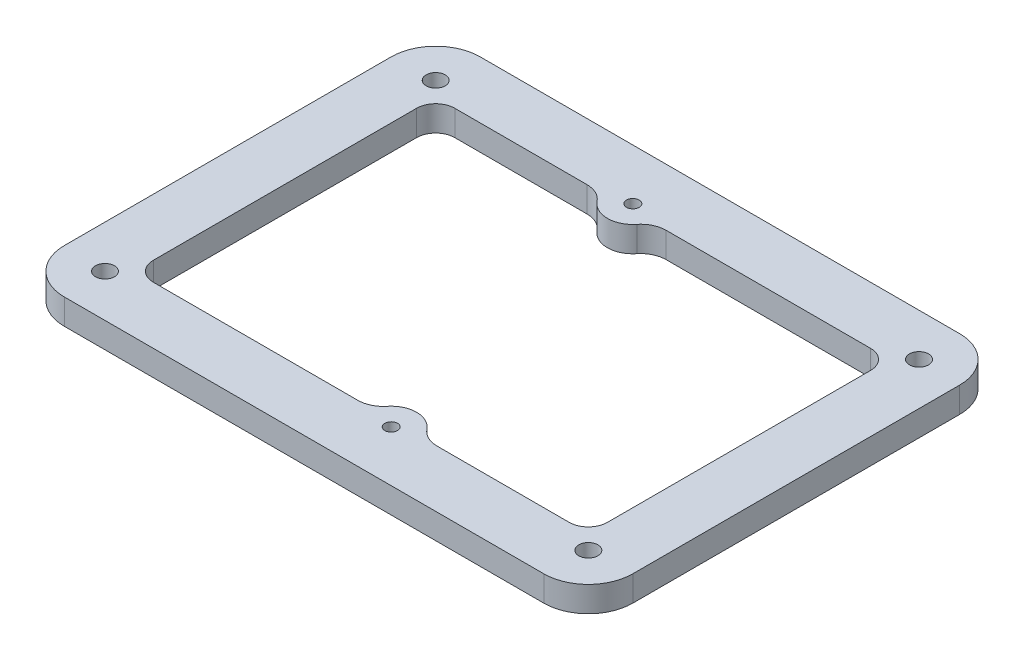
ISO-10303-21;
HEADER;
FILE_DESCRIPTION(('STEP AP214'),'2;1');
FILE_NAME('part.step','',(''),(''),'','','');
FILE_SCHEMA(('AUTOMOTIVE_DESIGN { 1 0 10303 214 1 1 1 1 }'));
ENDSEC;
DATA;
#1=APPLICATION_CONTEXT('core data for automotive mechanical design processes');
#2=APPLICATION_PROTOCOL_DEFINITION('international standard','automotive_design',2000,#1);
#3=PRODUCT_CONTEXT('',#1,'mechanical');
#4=PRODUCT('Part','Part','',(#3));
#5=PRODUCT_RELATED_PRODUCT_CATEGORY('part','',(#4));
#6=PRODUCT_DEFINITION_FORMATION('','',#4);
#7=PRODUCT_DEFINITION_CONTEXT('part definition',#1,'design');
#8=PRODUCT_DEFINITION('design','',#6,#7);
#9=PRODUCT_DEFINITION_SHAPE('','',#8);
#10=(LENGTH_UNIT() NAMED_UNIT(*) SI_UNIT(.MILLI.,.METRE.));
#11=(NAMED_UNIT(*) PLANE_ANGLE_UNIT() SI_UNIT($,.RADIAN.));
#12=(NAMED_UNIT(*) SI_UNIT($,.STERADIAN.) SOLID_ANGLE_UNIT());
#13=UNCERTAINTY_MEASURE_WITH_UNIT(LENGTH_MEASURE(1.E-05),#10,'distance_accuracy_value','');
#14=(GEOMETRIC_REPRESENTATION_CONTEXT(3) GLOBAL_UNCERTAINTY_ASSIGNED_CONTEXT((#13)) GLOBAL_UNIT_ASSIGNED_CONTEXT((#10,
#11,#12)) REPRESENTATION_CONTEXT('',''));
#15=CARTESIAN_POINT('',(0.,0.,0.));
#16=DIRECTION('',(0.,0.,1.));
#17=DIRECTION('',(1.,0.,0.));
#18=AXIS2_PLACEMENT_3D('',#15,#16,#17);
#19=CARTESIAN_POINT('',(0.,4.,0.));
#20=DIRECTION('',(0.,-1.,0.));
#21=DIRECTION('',(0.,0.,-1.));
#22=AXIS2_PLACEMENT_3D('',#19,#20,#21);
#23=PLANE('',#22);
#24=DIRECTION('',(0.,0.,-1.));
#25=VECTOR('',#24,1.);
#26=CARTESIAN_POINT('',(44.6966991411009,4.,20.6966991411009));
#27=LINE('',#26,#25);
#28=CARTESIAN_POINT('',(44.6966991411009,4.,25.6966991411009));
#29=VERTEX_POINT('',#28);
#30=CARTESIAN_POINT('',(44.6966991411009,4.,-25.6966991411009));
#31=VERTEX_POINT('',#30);
#32=EDGE_CURVE('E334',#29,#31,#27,.T.);
#33=ORIENTED_EDGE('',*,*,#32,.T.);
#34=CARTESIAN_POINT('',(37.6966991411009,4.,-25.6966991411009));
#35=DIRECTION('',(0.,-1.,0.));
#36=DIRECTION('',(0.,0.,-1.));
#37=AXIS2_PLACEMENT_3D('',#34,#35,#36);
#38=CIRCLE('',#37,7.00000000000001);
#39=CARTESIAN_POINT('',(37.6966991411009,4.,-32.6966991411009));
#40=VERTEX_POINT('',#39);
#41=EDGE_CURVE('E369',#31,#40,#38,.F.);
#42=ORIENTED_EDGE('',*,*,#41,.T.);
#43=DIRECTION('',(-1.,0.,0.));
#44=VECTOR('',#43,1.);
#45=CARTESIAN_POINT('',(-32.6966991411009,4.,-32.6966991411009));
#46=LINE('',#45,#44);
#47=CARTESIAN_POINT('',(-37.6966991411009,4.,-32.6966991411009));
#48=VERTEX_POINT('',#47);
#49=EDGE_CURVE('E326',#40,#48,#46,.T.);
#50=ORIENTED_EDGE('',*,*,#49,.T.);
#51=CARTESIAN_POINT('',(-37.6966991411009,4.,-25.6966991411009));
#52=DIRECTION('',(0.,-1.,0.));
#53=DIRECTION('',(0.,0.,-1.));
#54=AXIS2_PLACEMENT_3D('',#51,#52,#53);
#55=CIRCLE('',#54,7.00000000000001);
#56=CARTESIAN_POINT('',(-44.6966991411009,4.,-25.6966991411009));
#57=VERTEX_POINT('',#56);
#58=EDGE_CURVE('E367',#48,#57,#55,.F.);
#59=ORIENTED_EDGE('',*,*,#58,.T.);
#60=DIRECTION('',(0.,0.,1.));
#61=VECTOR('',#60,1.);
#62=CARTESIAN_POINT('',(-44.6966991411009,4.,-20.6966991411009));
#63=LINE('',#62,#61);
#64=CARTESIAN_POINT('',(-44.6966991411009,4.,25.6966991411009));
#65=VERTEX_POINT('',#64);
#66=EDGE_CURVE('E329',#57,#65,#63,.T.);
#67=ORIENTED_EDGE('',*,*,#66,.T.);
#68=CARTESIAN_POINT('',(-37.6966991411009,4.,25.6966991411009));
#69=DIRECTION('',(0.,-1.,0.));
#70=DIRECTION('',(0.,0.,-1.));
#71=AXIS2_PLACEMENT_3D('',#68,#69,#70);
#72=CIRCLE('',#71,7.00000000000001);
#73=CARTESIAN_POINT('',(-37.6966991411009,4.,32.6966991411009));
#74=VERTEX_POINT('',#73);
#75=EDGE_CURVE('E55',#65,#74,#72,.F.);
#76=ORIENTED_EDGE('',*,*,#75,.T.);
#77=DIRECTION('',(1.,0.,0.));
#78=VECTOR('',#77,1.);
#79=CARTESIAN_POINT('',(-32.6966991411009,4.,32.6966991411009));
#80=LINE('',#79,#78);
#81=CARTESIAN_POINT('',(37.6966991411009,4.,32.6966991411009));
#82=VERTEX_POINT('',#81);
#83=EDGE_CURVE('E332',#74,#82,#80,.T.);
#84=ORIENTED_EDGE('',*,*,#83,.T.);
#85=CARTESIAN_POINT('',(37.6966991411009,4.,25.6966991411009));
#86=DIRECTION('',(0.,-1.,0.));
#87=DIRECTION('',(0.,0.,-1.));
#88=AXIS2_PLACEMENT_3D('',#85,#86,#87);
#89=CIRCLE('',#88,7.00000000000001);
#90=EDGE_CURVE('E365',#82,#29,#89,.F.);
#91=ORIENTED_EDGE('',*,*,#90,.T.);
#92=EDGE_LOOP('',(#33,#42,#50,#59,#67,#76,#84,#91));
#93=FACE_BOUND('',#92,.T.);
#94=CARTESIAN_POINT('',(-11.9423546821787,4.,-19.6966991411009));
#95=DIRECTION('',(0.,1.,0.));
#96=DIRECTION('',(0.,0.,1.));
#97=AXIS2_PLACEMENT_3D('',#94,#95,#96);
#98=CIRCLE('',#97,4.);
#99=CARTESIAN_POINT('',(-8.82117772850447,4.,-22.198349481147));
#100=VERTEX_POINT('',#99);
#101=CARTESIAN_POINT('',(-11.9423546821787,4.,-23.6966991411009));
#102=VERTEX_POINT('',#101);
#103=EDGE_CURVE('E197',#100,#102,#98,.T.);
#104=ORIENTED_EDGE('',*,*,#103,.F.);
#105=CARTESIAN_POINT('',(-5.7000007748302,4.,-24.699999821193));
#106=DIRECTION('',(0.,-1.,0.));
#107=DIRECTION('',(0.,0.,1.));
#108=AXIS2_PLACEMENT_3D('',#105,#106,#107);
#109=CIRCLE('',#108,4.);
#110=CARTESIAN_POINT('',(-2.57882382115593,4.,-22.198349481147));
#111=VERTEX_POINT('',#110);
#112=EDGE_CURVE('E251',#111,#100,#109,.T.);
#113=ORIENTED_EDGE('',*,*,#112,.F.);
#114=CARTESIAN_POINT('',(0.542353132518346,4.,-19.6966991411009));
#115=DIRECTION('',(0.,1.,0.));
#116=DIRECTION('',(0.,0.,-1.));
#117=AXIS2_PLACEMENT_3D('',#114,#115,#116);
#118=CIRCLE('',#117,4.);
#119=CARTESIAN_POINT('',(0.542353132518346,4.,-23.6966991411009));
#120=VERTEX_POINT('',#119);
#121=EDGE_CURVE('E248',#120,#111,#118,.T.);
#122=ORIENTED_EDGE('',*,*,#121,.F.);
#123=DIRECTION('',(-1.,0.,0.));
#124=VECTOR('',#123,1.);
#125=CARTESIAN_POINT('',(0.542353132518344,4.,-23.6966991411009));
#126=LINE('',#125,#124);
#127=CARTESIAN_POINT('',(32.6966991411009,4.,-23.6966991411009));
#128=VERTEX_POINT('',#127);
#129=EDGE_CURVE('E246',#128,#120,#126,.T.);
#130=ORIENTED_EDGE('',*,*,#129,.F.);
#131=CARTESIAN_POINT('',(32.6966991411009,4.,-20.6966991411009));
#132=DIRECTION('',(0.,1.,0.));
#133=DIRECTION('',(0.,0.,1.));
#134=AXIS2_PLACEMENT_3D('',#131,#132,#133);
#135=CIRCLE('',#134,3.);
#136=CARTESIAN_POINT('',(35.6966991411009,4.,-20.6966991411009));
#137=VERTEX_POINT('',#136);
#138=EDGE_CURVE('E244',#137,#128,#135,.T.);
#139=ORIENTED_EDGE('',*,*,#138,.F.);
#140=DIRECTION('',(0.,0.,-1.));
#141=VECTOR('',#140,1.);
#142=CARTESIAN_POINT('',(35.6966991411009,4.,-20.6966991411009));
#143=LINE('',#142,#141);
#144=CARTESIAN_POINT('',(35.6966991411009,4.,20.6966991411009));
#145=VERTEX_POINT('',#144);
#146=EDGE_CURVE('E242',#145,#137,#143,.T.);
#147=ORIENTED_EDGE('',*,*,#146,.F.);
#148=CARTESIAN_POINT('',(32.6966991411009,4.,20.6966991411009));
#149=DIRECTION('',(0.,1.,0.));
#150=DIRECTION('',(0.,0.,1.));
#151=AXIS2_PLACEMENT_3D('',#148,#149,#150);
#152=CIRCLE('',#151,3.00000000000001);
#153=CARTESIAN_POINT('',(32.6966991411009,4.,23.6966991411009));
#154=VERTEX_POINT('',#153);
#155=EDGE_CURVE('E240',#154,#145,#152,.T.);
#156=ORIENTED_EDGE('',*,*,#155,.F.);
#157=DIRECTION('',(1.,0.,0.));
#158=VECTOR('',#157,1.);
#159=CARTESIAN_POINT('',(11.9423528458877,4.,23.6966991411009));
#160=LINE('',#159,#158);
#161=CARTESIAN_POINT('',(11.9423528458877,4.,23.6966991411009));
#162=VERTEX_POINT('',#161);
#163=EDGE_CURVE('E238',#162,#154,#160,.T.);
#164=ORIENTED_EDGE('',*,*,#163,.F.);
#165=CARTESIAN_POINT('',(11.9423528458877,4.,19.6966991411009));
#166=DIRECTION('',(0.,1.,0.));
#167=DIRECTION('',(0.,0.,1.));
#168=AXIS2_PLACEMENT_3D('',#165,#166,#167);
#169=CIRCLE('',#168,4.);
#170=CARTESIAN_POINT('',(8.82117603552874,4.,22.1983496599539));
#171=VERTEX_POINT('',#170);
#172=EDGE_CURVE('E236',#171,#162,#169,.T.);
#173=ORIENTED_EDGE('',*,*,#172,.F.);
#174=CARTESIAN_POINT('',(5.69999922516982,4.,24.700000178807));
#175=DIRECTION('',(0.,-1.,0.));
#176=DIRECTION('',(0.,0.,-1.));
#177=AXIS2_PLACEMENT_3D('',#174,#175,#176);
#178=CIRCLE('',#177,4.);
#179=CARTESIAN_POINT('',(2.57882241481089,4.,22.1983496599539));
#180=VERTEX_POINT('',#179);
#181=EDGE_CURVE('E234',#180,#171,#178,.T.);
#182=ORIENTED_EDGE('',*,*,#181,.F.);
#183=CARTESIAN_POINT('',(-0.542354395548028,4.,19.6966991411009));
#184=DIRECTION('',(0.,1.,0.));
#185=DIRECTION('',(0.,0.,-1.));
#186=AXIS2_PLACEMENT_3D('',#183,#184,#185);
#187=CIRCLE('',#186,4.);
#188=CARTESIAN_POINT('',(-0.542354395548027,4.,23.6966991411009));
#189=VERTEX_POINT('',#188);
#190=EDGE_CURVE('E232',#189,#180,#187,.T.);
#191=ORIENTED_EDGE('',*,*,#190,.F.);
#192=DIRECTION('',(1.,0.,0.));
#193=VECTOR('',#192,1.);
#194=CARTESIAN_POINT('',(-32.6966991411009,4.,23.6966991411009));
#195=LINE('',#194,#193);
#196=CARTESIAN_POINT('',(-32.6966991411009,4.,23.6966991411009));
#197=VERTEX_POINT('',#196);
#198=EDGE_CURVE('E230',#197,#189,#195,.T.);
#199=ORIENTED_EDGE('',*,*,#198,.F.);
#200=CARTESIAN_POINT('',(-32.6966991411009,4.,20.6966991411009));
#201=DIRECTION('',(0.,1.,0.));
#202=DIRECTION('',(0.,0.,1.));
#203=AXIS2_PLACEMENT_3D('',#200,#201,#202);
#204=CIRCLE('',#203,3.);
#205=CARTESIAN_POINT('',(-35.6966991411009,4.,20.6966991411009));
#206=VERTEX_POINT('',#205);
#207=EDGE_CURVE('E228',#206,#197,#204,.T.);
#208=ORIENTED_EDGE('',*,*,#207,.F.);
#209=DIRECTION('',(0.,0.,1.));
#210=VECTOR('',#209,1.);
#211=CARTESIAN_POINT('',(-35.6966991411009,4.,-20.6966991411009));
#212=LINE('',#211,#210);
#213=CARTESIAN_POINT('',(-35.6966991411009,4.,-20.6966991411009));
#214=VERTEX_POINT('',#213);
#215=EDGE_CURVE('E223',#214,#206,#212,.T.);
#216=ORIENTED_EDGE('',*,*,#215,.F.);
#217=CARTESIAN_POINT('',(-32.6966991411009,4.,-20.6966991411009));
#218=DIRECTION('',(0.,1.,0.));
#219=DIRECTION('',(0.,0.,1.));
#220=AXIS2_PLACEMENT_3D('',#217,#218,#219);
#221=CIRCLE('',#220,3.);
#222=CARTESIAN_POINT('',(-32.6966991411009,4.,-23.6966991411009));
#223=VERTEX_POINT('',#222);
#224=EDGE_CURVE('E221',#223,#214,#221,.T.);
#225=ORIENTED_EDGE('',*,*,#224,.F.);
#226=DIRECTION('',(-1.,0.,0.));
#227=VECTOR('',#226,1.);
#228=CARTESIAN_POINT('',(-32.6966991411009,4.,-23.6966991411009));
#229=LINE('',#228,#227);
#230=EDGE_CURVE('E207',#102,#223,#229,.T.);
#231=ORIENTED_EDGE('',*,*,#230,.F.);
#232=EDGE_LOOP('',(#104,#113,#122,#130,#139,#147,#156,#164,#173,#182,#191,#199,#208,#216,#225,#231));
#233=FACE_BOUND('',#232,.T.);
#234=CARTESIAN_POINT('',(-38.,4.,-26.));
#235=DIRECTION('',(0.,1.,0.));
#236=DIRECTION('',(0.,0.,-1.));
#237=AXIS2_PLACEMENT_3D('',#234,#235,#236);
#238=CIRCLE('',#237,1.5);
#239=CARTESIAN_POINT('',(-38.,4.,-27.5));
#240=VERTEX_POINT('',#239);
#241=EDGE_CURVE('E255',#240,#240,#238,.T.);
#242=ORIENTED_EDGE('',*,*,#241,.F.);
#243=EDGE_LOOP('',(#242));
#244=FACE_BOUND('',#243,.T.);
#245=CARTESIAN_POINT('',(38.,4.,26.));
#246=DIRECTION('',(0.,1.,0.));
#247=DIRECTION('',(0.,0.,-1.));
#248=AXIS2_PLACEMENT_3D('',#245,#246,#247);
#249=CIRCLE('',#248,1.5);
#250=CARTESIAN_POINT('',(38.,4.,24.5));
#251=VERTEX_POINT('',#250);
#252=EDGE_CURVE('E800',#251,#251,#249,.T.);
#253=ORIENTED_EDGE('',*,*,#252,.F.);
#254=EDGE_LOOP('',(#253));
#255=FACE_BOUND('',#254,.T.);
#256=CARTESIAN_POINT('',(38.,4.,-26.));
#257=DIRECTION('',(0.,1.,0.));
#258=DIRECTION('',(0.,0.,1.));
#259=AXIS2_PLACEMENT_3D('',#256,#257,#258);
#260=CIRCLE('',#259,1.5);
#261=CARTESIAN_POINT('',(38.,4.,-24.5));
#262=VERTEX_POINT('',#261);
#263=EDGE_CURVE('E795',#262,#262,#260,.T.);
#264=ORIENTED_EDGE('',*,*,#263,.F.);
#265=EDGE_LOOP('',(#264));
#266=FACE_BOUND('',#265,.T.);
#267=CARTESIAN_POINT('',(-38.,4.,26.));
#268=DIRECTION('',(0.,1.,0.));
#269=DIRECTION('',(0.,0.,1.));
#270=AXIS2_PLACEMENT_3D('',#267,#268,#269);
#271=CIRCLE('',#270,1.5);
#272=CARTESIAN_POINT('',(-38.,4.,27.5));
#273=VERTEX_POINT('',#272);
#274=EDGE_CURVE('E790',#273,#273,#271,.T.);
#275=ORIENTED_EDGE('',*,*,#274,.F.);
#276=EDGE_LOOP('',(#275));
#277=FACE_BOUND('',#276,.T.);
#278=CARTESIAN_POINT('',(-5.7000007748302,4.,-24.699999821193));
#279=DIRECTION('',(0.,1.,0.));
#280=DIRECTION('',(0.,0.,1.));
#281=AXIS2_PLACEMENT_3D('',#278,#279,#280);
#282=CIRCLE('',#281,1.00000000000001);
#283=CARTESIAN_POINT('',(-5.7000007748302,4.,-23.699999821193));
#284=VERTEX_POINT('',#283);
#285=EDGE_CURVE('E785',#284,#284,#282,.T.);
#286=ORIENTED_EDGE('',*,*,#285,.F.);
#287=EDGE_LOOP('',(#286));
#288=FACE_BOUND('',#287,.T.);
#289=CARTESIAN_POINT('',(5.69999922516982,4.,24.700000178807));
#290=DIRECTION('',(0.,1.,0.));
#291=DIRECTION('',(0.,0.,1.));
#292=AXIS2_PLACEMENT_3D('',#289,#290,#291);
#293=CIRCLE('',#292,1.00000000000001);
#294=CARTESIAN_POINT('',(5.69999922516982,4.,25.700000178807));
#295=VERTEX_POINT('',#294);
#296=EDGE_CURVE('E779',#295,#295,#293,.T.);
#297=ORIENTED_EDGE('',*,*,#296,.F.);
#298=EDGE_LOOP('',(#297));
#299=FACE_BOUND('',#298,.T.);
#300=ADVANCED_FACE('F35',(#93,#233,#244,#255,#266,#277,#288,#299),#23,.F.);
#301=CARTESIAN_POINT('',(0.,0.,0.));
#302=DIRECTION('',(0.,-1.,0.));
#303=DIRECTION('',(0.,0.,-1.));
#304=AXIS2_PLACEMENT_3D('',#301,#302,#303);
#305=PLANE('',#304);
#306=CARTESIAN_POINT('',(-5.7000007748302,0.,-24.699999821193));
#307=DIRECTION('',(0.,1.,0.));
#308=DIRECTION('',(0.,0.,1.));
#309=AXIS2_PLACEMENT_3D('',#306,#307,#308);
#310=CIRCLE('',#309,1.00000000000001);
#311=CARTESIAN_POINT('',(-5.7000007748302,0.,-23.699999821193));
#312=VERTEX_POINT('',#311);
#313=EDGE_CURVE('E782',#312,#312,#310,.T.);
#314=ORIENTED_EDGE('',*,*,#313,.T.);
#315=EDGE_LOOP('',(#314));
#316=FACE_BOUND('',#315,.T.);
#317=CARTESIAN_POINT('',(38.,0.,-26.));
#318=DIRECTION('',(0.,1.,0.));
#319=DIRECTION('',(0.,0.,1.));
#320=AXIS2_PLACEMENT_3D('',#317,#318,#319);
#321=CIRCLE('',#320,1.5);
#322=CARTESIAN_POINT('',(38.,0.,-24.5));
#323=VERTEX_POINT('',#322);
#324=EDGE_CURVE('E793',#323,#323,#321,.T.);
#325=ORIENTED_EDGE('',*,*,#324,.T.);
#326=EDGE_LOOP('',(#325));
#327=FACE_BOUND('',#326,.T.);
#328=CARTESIAN_POINT('',(-38.,0.,-26.));
#329=DIRECTION('',(0.,1.,0.));
#330=DIRECTION('',(0.,0.,-1.));
#331=AXIS2_PLACEMENT_3D('',#328,#329,#330);
#332=CIRCLE('',#331,1.5);
#333=CARTESIAN_POINT('',(-38.,0.,-27.5));
#334=VERTEX_POINT('',#333);
#335=EDGE_CURVE('E803',#334,#334,#332,.T.);
#336=ORIENTED_EDGE('',*,*,#335,.T.);
#337=EDGE_LOOP('',(#336));
#338=FACE_BOUND('',#337,.T.);
#339=DIRECTION('',(-1.,0.,0.));
#340=VECTOR('',#339,1.);
#341=CARTESIAN_POINT('',(-32.6966991411009,0.,-32.6966991411009));
#342=LINE('',#341,#340);
#343=CARTESIAN_POINT('',(37.6966991411009,0.,-32.6966991411009));
#344=VERTEX_POINT('',#343);
#345=CARTESIAN_POINT('',(-37.6966991411009,0.,-32.6966991411009));
#346=VERTEX_POINT('',#345);
#347=EDGE_CURVE('E330',#344,#346,#342,.T.);
#348=ORIENTED_EDGE('',*,*,#347,.F.);
#349=CARTESIAN_POINT('',(37.6966991411009,0.,-25.6966991411009));
#350=DIRECTION('',(0.,-1.,0.));
#351=DIRECTION('',(0.,0.,-1.));
#352=AXIS2_PLACEMENT_3D('',#349,#350,#351);
#353=CIRCLE('',#352,7.00000000000001);
#354=CARTESIAN_POINT('',(44.6966991411009,0.,-25.6966991411009));
#355=VERTEX_POINT('',#354);
#356=EDGE_CURVE('E357',#344,#355,#353,.T.);
#357=ORIENTED_EDGE('',*,*,#356,.T.);
#358=DIRECTION('',(0.,0.,-1.));
#359=VECTOR('',#358,1.);
#360=CARTESIAN_POINT('',(44.6966991411009,0.,-20.6966991411009));
#361=LINE('',#360,#359);
#362=CARTESIAN_POINT('',(44.6966991411009,0.,25.6966991411009));
#363=VERTEX_POINT('',#362);
#364=EDGE_CURVE('E342',#363,#355,#361,.T.);
#365=ORIENTED_EDGE('',*,*,#364,.F.);
#366=CARTESIAN_POINT('',(37.6966991411009,0.,25.6966991411009));
#367=DIRECTION('',(0.,-1.,0.));
#368=DIRECTION('',(0.,0.,-1.));
#369=AXIS2_PLACEMENT_3D('',#366,#367,#368);
#370=CIRCLE('',#369,7.00000000000001);
#371=CARTESIAN_POINT('',(37.6966991411009,0.,32.6966991411009));
#372=VERTEX_POINT('',#371);
#373=EDGE_CURVE('E353',#363,#372,#370,.T.);
#374=ORIENTED_EDGE('',*,*,#373,.T.);
#375=DIRECTION('',(1.,0.,0.));
#376=VECTOR('',#375,1.);
#377=CARTESIAN_POINT('',(32.6966991411008,0.,32.6966991411009));
#378=LINE('',#377,#376);
#379=CARTESIAN_POINT('',(-37.6966991411009,0.,32.6966991411009));
#380=VERTEX_POINT('',#379);
#381=EDGE_CURVE('E340',#380,#372,#378,.T.);
#382=ORIENTED_EDGE('',*,*,#381,.F.);
#383=CARTESIAN_POINT('',(-37.6966991411009,0.,25.6966991411009));
#384=DIRECTION('',(0.,-1.,0.));
#385=DIRECTION('',(0.,0.,-1.));
#386=AXIS2_PLACEMENT_3D('',#383,#384,#385);
#387=CIRCLE('',#386,7.00000000000001);
#388=CARTESIAN_POINT('',(-44.6966991411009,0.,25.6966991411009));
#389=VERTEX_POINT('',#388);
#390=EDGE_CURVE('E351',#380,#389,#387,.T.);
#391=ORIENTED_EDGE('',*,*,#390,.T.);
#392=DIRECTION('',(0.,0.,1.));
#393=VECTOR('',#392,1.);
#394=CARTESIAN_POINT('',(-44.6966991411009,0.,20.6966991411009));
#395=LINE('',#394,#393);
#396=CARTESIAN_POINT('',(-44.6966991411009,0.,-25.6966991411009));
#397=VERTEX_POINT('',#396);
#398=EDGE_CURVE('E215',#397,#389,#395,.T.);
#399=ORIENTED_EDGE('',*,*,#398,.F.);
#400=CARTESIAN_POINT('',(-37.6966991411009,0.,-25.6966991411009));
#401=DIRECTION('',(0.,-1.,0.));
#402=DIRECTION('',(0.,0.,-1.));
#403=AXIS2_PLACEMENT_3D('',#400,#401,#402);
#404=CIRCLE('',#403,7.00000000000001);
#405=EDGE_CURVE('E355',#397,#346,#404,.T.);
#406=ORIENTED_EDGE('',*,*,#405,.T.);
#407=EDGE_LOOP('',(#348,#357,#365,#374,#382,#391,#399,#406));
#408=FACE_BOUND('',#407,.T.);
#409=CARTESIAN_POINT('',(-5.7000007748302,0.,-24.699999821193));
#410=DIRECTION('',(0.,-1.,0.));
#411=DIRECTION('',(0.,0.,1.));
#412=AXIS2_PLACEMENT_3D('',#409,#410,#411);
#413=CIRCLE('',#412,4.);
#414=CARTESIAN_POINT('',(-2.57882382115593,0.,-22.198349481147));
#415=VERTEX_POINT('',#414);
#416=CARTESIAN_POINT('',(-8.82117772850447,0.,-22.198349481147));
#417=VERTEX_POINT('',#416);
#418=EDGE_CURVE('E208',#415,#417,#413,.T.);
#419=ORIENTED_EDGE('',*,*,#418,.T.);
#420=CARTESIAN_POINT('',(-11.9423546821787,0.,-19.6966991411009));
#421=DIRECTION('',(0.,1.,0.));
#422=DIRECTION('',(0.,0.,1.));
#423=AXIS2_PLACEMENT_3D('',#420,#421,#422);
#424=CIRCLE('',#423,4.);
#425=CARTESIAN_POINT('',(-11.9423546821787,0.,-23.6966991411009));
#426=VERTEX_POINT('',#425);
#427=EDGE_CURVE('E253',#417,#426,#424,.T.);
#428=ORIENTED_EDGE('',*,*,#427,.T.);
#429=DIRECTION('',(-1.,0.,0.));
#430=VECTOR('',#429,1.);
#431=CARTESIAN_POINT('',(-32.6966991411009,0.,-23.6966991411009));
#432=LINE('',#431,#430);
#433=CARTESIAN_POINT('',(-32.6966991411009,0.,-23.6966991411009));
#434=VERTEX_POINT('',#433);
#435=EDGE_CURVE('E214',#426,#434,#432,.T.);
#436=ORIENTED_EDGE('',*,*,#435,.T.);
#437=CARTESIAN_POINT('',(-32.6966991411009,0.,-20.6966991411009));
#438=DIRECTION('',(0.,1.,0.));
#439=DIRECTION('',(0.,0.,1.));
#440=AXIS2_PLACEMENT_3D('',#437,#438,#439);
#441=CIRCLE('',#440,3.);
#442=CARTESIAN_POINT('',(-35.6966991411009,0.,-20.6966991411009));
#443=VERTEX_POINT('',#442);
#444=EDGE_CURVE('E257',#434,#443,#441,.T.);
#445=ORIENTED_EDGE('',*,*,#444,.T.);
#446=DIRECTION('',(0.,0.,1.));
#447=VECTOR('',#446,1.);
#448=CARTESIAN_POINT('',(-35.6966991411009,0.,-20.6966991411009));
#449=LINE('',#448,#447);
#450=CARTESIAN_POINT('',(-35.6966991411009,0.,20.6966991411009));
#451=VERTEX_POINT('',#450);
#452=EDGE_CURVE('E260',#443,#451,#449,.T.);
#453=ORIENTED_EDGE('',*,*,#452,.T.);
#454=CARTESIAN_POINT('',(-32.6966991411009,0.,20.6966991411009));
#455=DIRECTION('',(0.,1.,0.));
#456=DIRECTION('',(0.,0.,1.));
#457=AXIS2_PLACEMENT_3D('',#454,#455,#456);
#458=CIRCLE('',#457,3.);
#459=CARTESIAN_POINT('',(-32.6966991411009,0.,23.6966991411009));
#460=VERTEX_POINT('',#459);
#461=EDGE_CURVE('E263',#451,#460,#458,.T.);
#462=ORIENTED_EDGE('',*,*,#461,.T.);
#463=DIRECTION('',(1.,0.,0.));
#464=VECTOR('',#463,1.);
#465=CARTESIAN_POINT('',(-32.6966991411009,0.,23.6966991411009));
#466=LINE('',#465,#464);
#467=CARTESIAN_POINT('',(-0.542354395548027,0.,23.6966991411009));
#468=VERTEX_POINT('',#467);
#469=EDGE_CURVE('E266',#460,#468,#466,.T.);
#470=ORIENTED_EDGE('',*,*,#469,.T.);
#471=CARTESIAN_POINT('',(-0.542354395548028,0.,19.6966991411009));
#472=DIRECTION('',(0.,1.,0.));
#473=DIRECTION('',(0.,0.,-1.));
#474=AXIS2_PLACEMENT_3D('',#471,#472,#473);
#475=CIRCLE('',#474,4.);
#476=CARTESIAN_POINT('',(2.57882241481089,0.,22.1983496599539));
#477=VERTEX_POINT('',#476);
#478=EDGE_CURVE('E269',#468,#477,#475,.T.);
#479=ORIENTED_EDGE('',*,*,#478,.T.);
#480=CARTESIAN_POINT('',(5.69999922516982,0.,24.700000178807));
#481=DIRECTION('',(0.,-1.,0.));
#482=DIRECTION('',(0.,0.,-1.));
#483=AXIS2_PLACEMENT_3D('',#480,#481,#482);
#484=CIRCLE('',#483,4.);
#485=CARTESIAN_POINT('',(8.82117603552874,0.,22.1983496599539));
#486=VERTEX_POINT('',#485);
#487=EDGE_CURVE('E272',#477,#486,#484,.T.);
#488=ORIENTED_EDGE('',*,*,#487,.T.);
#489=CARTESIAN_POINT('',(11.9423528458877,0.,19.6966991411009));
#490=DIRECTION('',(0.,1.,0.));
#491=DIRECTION('',(0.,0.,1.));
#492=AXIS2_PLACEMENT_3D('',#489,#490,#491);
#493=CIRCLE('',#492,4.);
#494=CARTESIAN_POINT('',(11.9423528458877,0.,23.6966991411009));
#495=VERTEX_POINT('',#494);
#496=EDGE_CURVE('E275',#486,#495,#493,.T.);
#497=ORIENTED_EDGE('',*,*,#496,.T.);
#498=DIRECTION('',(1.,0.,0.));
#499=VECTOR('',#498,1.);
#500=CARTESIAN_POINT('',(11.9423528458877,0.,23.6966991411009));
#501=LINE('',#500,#499);
#502=CARTESIAN_POINT('',(32.6966991411009,0.,23.6966991411009));
#503=VERTEX_POINT('',#502);
#504=EDGE_CURVE('E278',#495,#503,#501,.T.);
#505=ORIENTED_EDGE('',*,*,#504,.T.);
#506=CARTESIAN_POINT('',(32.6966991411009,0.,20.6966991411009));
#507=DIRECTION('',(0.,1.,0.));
#508=DIRECTION('',(0.,0.,1.));
#509=AXIS2_PLACEMENT_3D('',#506,#507,#508);
#510=CIRCLE('',#509,3.00000000000001);
#511=CARTESIAN_POINT('',(35.6966991411009,0.,20.6966991411009));
#512=VERTEX_POINT('',#511);
#513=EDGE_CURVE('E281',#503,#512,#510,.T.);
#514=ORIENTED_EDGE('',*,*,#513,.T.);
#515=DIRECTION('',(0.,0.,-1.));
#516=VECTOR('',#515,1.);
#517=CARTESIAN_POINT('',(35.6966991411009,0.,-20.6966991411009));
#518=LINE('',#517,#516);
#519=CARTESIAN_POINT('',(35.6966991411009,0.,-20.6966991411009));
#520=VERTEX_POINT('',#519);
#521=EDGE_CURVE('E284',#512,#520,#518,.T.);
#522=ORIENTED_EDGE('',*,*,#521,.T.);
#523=CARTESIAN_POINT('',(32.6966991411009,0.,-20.6966991411009));
#524=DIRECTION('',(0.,1.,0.));
#525=DIRECTION('',(0.,0.,1.));
#526=AXIS2_PLACEMENT_3D('',#523,#524,#525);
#527=CIRCLE('',#526,3.);
#528=CARTESIAN_POINT('',(32.6966991411009,0.,-23.6966991411009));
#529=VERTEX_POINT('',#528);
#530=EDGE_CURVE('E287',#520,#529,#527,.T.);
#531=ORIENTED_EDGE('',*,*,#530,.T.);
#532=DIRECTION('',(-1.,0.,0.));
#533=VECTOR('',#532,1.);
#534=CARTESIAN_POINT('',(0.542353132518344,0.,-23.6966991411009));
#535=LINE('',#534,#533);
#536=CARTESIAN_POINT('',(0.542353132518346,0.,-23.6966991411009));
#537=VERTEX_POINT('',#536);
#538=EDGE_CURVE('E290',#529,#537,#535,.T.);
#539=ORIENTED_EDGE('',*,*,#538,.T.);
#540=CARTESIAN_POINT('',(0.542353132518346,0.,-19.6966991411009));
#541=DIRECTION('',(0.,1.,0.));
#542=DIRECTION('',(0.,0.,-1.));
#543=AXIS2_PLACEMENT_3D('',#540,#541,#542);
#544=CIRCLE('',#543,4.);
#545=EDGE_CURVE('E293',#537,#415,#544,.T.);
#546=ORIENTED_EDGE('',*,*,#545,.T.);
#547=EDGE_LOOP('',(#419,#428,#436,#445,#453,#462,#470,#479,#488,#497,#505,#514,#522,#531,#539,#546));
#548=FACE_BOUND('',#547,.T.);
#549=CARTESIAN_POINT('',(38.,0.,26.));
#550=DIRECTION('',(0.,1.,0.));
#551=DIRECTION('',(0.,0.,-1.));
#552=AXIS2_PLACEMENT_3D('',#549,#550,#551);
#553=CIRCLE('',#552,1.5);
#554=CARTESIAN_POINT('',(38.,0.,24.5));
#555=VERTEX_POINT('',#554);
#556=EDGE_CURVE('E770',#555,#555,#553,.T.);
#557=ORIENTED_EDGE('',*,*,#556,.T.);
#558=EDGE_LOOP('',(#557));
#559=FACE_BOUND('',#558,.T.);
#560=CARTESIAN_POINT('',(-38.,0.,26.));
#561=DIRECTION('',(0.,1.,0.));
#562=DIRECTION('',(0.,0.,1.));
#563=AXIS2_PLACEMENT_3D('',#560,#561,#562);
#564=CIRCLE('',#563,1.5);
#565=CARTESIAN_POINT('',(-38.,0.,27.5));
#566=VERTEX_POINT('',#565);
#567=EDGE_CURVE('E774',#566,#566,#564,.T.);
#568=ORIENTED_EDGE('',*,*,#567,.T.);
#569=EDGE_LOOP('',(#568));
#570=FACE_BOUND('',#569,.T.);
#571=CARTESIAN_POINT('',(5.69999922516982,0.,24.700000178807));
#572=DIRECTION('',(0.,1.,0.));
#573=DIRECTION('',(0.,0.,1.));
#574=AXIS2_PLACEMENT_3D('',#571,#572,#573);
#575=CIRCLE('',#574,1.00000000000001);
#576=CARTESIAN_POINT('',(5.69999922516982,0.,25.700000178807));
#577=VERTEX_POINT('',#576);
#578=EDGE_CURVE('E777',#577,#577,#575,.T.);
#579=ORIENTED_EDGE('',*,*,#578,.T.);
#580=EDGE_LOOP('',(#579));
#581=FACE_BOUND('',#580,.T.);
#582=ADVANCED_FACE('F382',(#316,#327,#338,#408,#548,#559,#570,#581),#305,.T.);
#583=CARTESIAN_POINT('',(-44.6966991411009,4.,20.6966991411009));
#584=DIRECTION('',(1.,0.,0.));
#585=DIRECTION('',(0.,0.,-1.));
#586=AXIS2_PLACEMENT_3D('',#583,#584,#585);
#587=PLANE('',#586);
#588=ORIENTED_EDGE('',*,*,#66,.F.);
#589=DIRECTION('',(0.,-1.,0.));
#590=VECTOR('',#589,1.);
#591=CARTESIAN_POINT('',(-44.6966991411009,4.,-25.6966991411009));
#592=LINE('',#591,#590);
#593=EDGE_CURVE('E373',#57,#397,#592,.T.);
#594=ORIENTED_EDGE('',*,*,#593,.T.);
#595=ORIENTED_EDGE('',*,*,#398,.T.);
#596=DIRECTION('',(0.,-1.,0.));
#597=VECTOR('',#596,1.);
#598=CARTESIAN_POINT('',(-44.6966991411009,4.,25.6966991411009));
#599=LINE('',#598,#597);
#600=EDGE_CURVE('E371',#389,#65,#599,.F.);
#601=ORIENTED_EDGE('',*,*,#600,.T.);
#602=EDGE_LOOP('',(#588,#594,#595,#601));
#603=FACE_BOUND('',#602,.T.);
#604=ADVANCED_FACE('F408',(#603),#587,.F.);
#605=CARTESIAN_POINT('',(32.6966991411008,4.,32.6966991411009));
#606=DIRECTION('',(0.,0.,-1.));
#607=DIRECTION('',(-1.,0.,0.));
#608=AXIS2_PLACEMENT_3D('',#605,#606,#607);
#609=PLANE('',#608);
#610=ORIENTED_EDGE('',*,*,#381,.T.);
#611=DIRECTION('',(0.,-1.,0.));
#612=VECTOR('',#611,1.);
#613=CARTESIAN_POINT('',(37.6966991411009,4.,32.6966991411009));
#614=LINE('',#613,#612);
#615=EDGE_CURVE('E11',#372,#82,#614,.F.);
#616=ORIENTED_EDGE('',*,*,#615,.T.);
#617=ORIENTED_EDGE('',*,*,#83,.F.);
#618=DIRECTION('',(0.,-1.,0.));
#619=VECTOR('',#618,1.);
#620=CARTESIAN_POINT('',(-37.6966991411009,4.,32.6966991411009));
#621=LINE('',#620,#619);
#622=EDGE_CURVE('E43',#74,#380,#621,.T.);
#623=ORIENTED_EDGE('',*,*,#622,.T.);
#624=EDGE_LOOP('',(#610,#616,#617,#623));
#625=FACE_BOUND('',#624,.T.);
#626=ADVANCED_FACE('F378',(#625),#609,.F.);
#627=CARTESIAN_POINT('',(44.6966991411009,4.,-20.6966991411009));
#628=DIRECTION('',(-1.,0.,0.));
#629=DIRECTION('',(0.,0.,1.));
#630=AXIS2_PLACEMENT_3D('',#627,#628,#629);
#631=PLANE('',#630);
#632=ORIENTED_EDGE('',*,*,#364,.T.);
#633=DIRECTION('',(0.,-1.,0.));
#634=VECTOR('',#633,1.);
#635=CARTESIAN_POINT('',(44.6966991411009,4.,-25.6966991411009));
#636=LINE('',#635,#634);
#637=EDGE_CURVE('E362',#355,#31,#636,.F.);
#638=ORIENTED_EDGE('',*,*,#637,.T.);
#639=ORIENTED_EDGE('',*,*,#32,.F.);
#640=DIRECTION('',(0.,-1.,0.));
#641=VECTOR('',#640,1.);
#642=CARTESIAN_POINT('',(44.6966991411009,4.,25.6966991411009));
#643=LINE('',#642,#641);
#644=EDGE_CURVE('E359',#29,#363,#643,.T.);
#645=ORIENTED_EDGE('',*,*,#644,.T.);
#646=EDGE_LOOP('',(#632,#638,#639,#645));
#647=FACE_BOUND('',#646,.T.);
#648=ADVANCED_FACE('F392',(#647),#631,.F.);
#649=CARTESIAN_POINT('',(-32.6966991411009,4.,-32.6966991411009));
#650=DIRECTION('',(0.,0.,1.));
#651=DIRECTION('',(1.,0.,0.));
#652=AXIS2_PLACEMENT_3D('',#649,#650,#651);
#653=PLANE('',#652);
#654=ORIENTED_EDGE('',*,*,#49,.F.);
#655=DIRECTION('',(0.,-1.,0.));
#656=VECTOR('',#655,1.);
#657=CARTESIAN_POINT('',(37.6966991411009,4.,-32.6966991411009));
#658=LINE('',#657,#656);
#659=EDGE_CURVE('E348',#40,#344,#658,.T.);
#660=ORIENTED_EDGE('',*,*,#659,.T.);
#661=ORIENTED_EDGE('',*,*,#347,.T.);
#662=DIRECTION('',(0.,-1.,0.));
#663=VECTOR('',#662,1.);
#664=CARTESIAN_POINT('',(-37.6966991411009,4.,-32.6966991411009));
#665=LINE('',#664,#663);
#666=EDGE_CURVE('E337',#346,#48,#665,.F.);
#667=ORIENTED_EDGE('',*,*,#666,.T.);
#668=EDGE_LOOP('',(#654,#660,#661,#667));
#669=FACE_BOUND('',#668,.T.);
#670=ADVANCED_FACE('F400',(#669),#653,.F.);
#671=CARTESIAN_POINT('',(-11.9423546821787,4.,-19.6966991411009));
#672=DIRECTION('',(0.,-1.,0.));
#673=DIRECTION('',(0.,0.,-1.));
#674=AXIS2_PLACEMENT_3D('',#671,#672,#673);
#675=CYLINDRICAL_SURFACE('',#674,4.);
#676=ORIENTED_EDGE('',*,*,#427,.F.);
#677=DIRECTION('',(0.,-1.,0.));
#678=VECTOR('',#677,1.);
#679=CARTESIAN_POINT('',(-8.82117772850447,4.,-22.198349481147));
#680=LINE('',#679,#678);
#681=EDGE_CURVE('E203',#100,#417,#680,.T.);
#682=ORIENTED_EDGE('',*,*,#681,.F.);
#683=ORIENTED_EDGE('',*,*,#103,.T.);
#684=DIRECTION('',(0.,-1.,0.));
#685=VECTOR('',#684,1.);
#686=CARTESIAN_POINT('',(-11.9423546821787,4.,-23.6966991411009));
#687=LINE('',#686,#685);
#688=EDGE_CURVE('E200',#102,#426,#687,.T.);
#689=ORIENTED_EDGE('',*,*,#688,.T.);
#690=EDGE_LOOP('',(#676,#682,#683,#689));
#691=FACE_BOUND('',#690,.T.);
#692=ADVANCED_FACE('F199',(#691),#675,.F.);
#693=CARTESIAN_POINT('',(-32.6966991411009,4.,-23.6966991411009));
#694=DIRECTION('',(0.,0.,1.));
#695=DIRECTION('',(1.,0.,0.));
#696=AXIS2_PLACEMENT_3D('',#693,#694,#695);
#697=PLANE('',#696);
#698=ORIENTED_EDGE('',*,*,#435,.F.);
#699=ORIENTED_EDGE('',*,*,#688,.F.);
#700=ORIENTED_EDGE('',*,*,#230,.T.);
#701=DIRECTION('',(0.,-1.,0.));
#702=VECTOR('',#701,1.);
#703=CARTESIAN_POINT('',(-32.6966991411009,4.,-23.6966991411009));
#704=LINE('',#703,#702);
#705=EDGE_CURVE('E216',#223,#434,#704,.T.);
#706=ORIENTED_EDGE('',*,*,#705,.T.);
#707=EDGE_LOOP('',(#698,#699,#700,#706));
#708=FACE_BOUND('',#707,.T.);
#709=ADVANCED_FACE('F211',(#708),#697,.T.);
#710=CARTESIAN_POINT('',(-32.6966991411009,4.,-20.6966991411009));
#711=DIRECTION('',(0.,-1.,0.));
#712=DIRECTION('',(0.,0.,-1.));
#713=AXIS2_PLACEMENT_3D('',#710,#711,#712);
#714=CYLINDRICAL_SURFACE('',#713,3.);
#715=ORIENTED_EDGE('',*,*,#444,.F.);
#716=ORIENTED_EDGE('',*,*,#705,.F.);
#717=ORIENTED_EDGE('',*,*,#224,.T.);
#718=DIRECTION('',(0.,-1.,0.));
#719=VECTOR('',#718,1.);
#720=CARTESIAN_POINT('',(-35.6966991411009,4.,-20.6966991411009));
#721=LINE('',#720,#719);
#722=EDGE_CURVE('E323',#214,#443,#721,.T.);
#723=ORIENTED_EDGE('',*,*,#722,.T.);
#724=EDGE_LOOP('',(#715,#716,#717,#723));
#725=FACE_BOUND('',#724,.T.);
#726=ADVANCED_FACE('F627',(#725),#714,.F.);
#727=CARTESIAN_POINT('',(-35.6966991411009,4.,-20.6966991411009));
#728=DIRECTION('',(1.,0.,0.));
#729=DIRECTION('',(0.,0.,-1.));
#730=AXIS2_PLACEMENT_3D('',#727,#728,#729);
#731=PLANE('',#730);
#732=ORIENTED_EDGE('',*,*,#452,.F.);
#733=ORIENTED_EDGE('',*,*,#722,.F.);
#734=ORIENTED_EDGE('',*,*,#215,.T.);
#735=DIRECTION('',(0.,-1.,0.));
#736=VECTOR('',#735,1.);
#737=CARTESIAN_POINT('',(-35.6966991411009,4.,20.6966991411009));
#738=LINE('',#737,#736);
#739=EDGE_CURVE('E321',#206,#451,#738,.T.);
#740=ORIENTED_EDGE('',*,*,#739,.T.);
#741=EDGE_LOOP('',(#732,#733,#734,#740));
#742=FACE_BOUND('',#741,.T.);
#743=ADVANCED_FACE('F618',(#742),#731,.T.);
#744=CARTESIAN_POINT('',(-32.6966991411009,4.,20.6966991411009));
#745=DIRECTION('',(0.,-1.,0.));
#746=DIRECTION('',(0.,0.,-1.));
#747=AXIS2_PLACEMENT_3D('',#744,#745,#746);
#748=CYLINDRICAL_SURFACE('',#747,3.);
#749=ORIENTED_EDGE('',*,*,#461,.F.);
#750=ORIENTED_EDGE('',*,*,#739,.F.);
#751=ORIENTED_EDGE('',*,*,#207,.T.);
#752=DIRECTION('',(0.,-1.,0.));
#753=VECTOR('',#752,1.);
#754=CARTESIAN_POINT('',(-32.6966991411009,4.,23.6966991411009));
#755=LINE('',#754,#753);
#756=EDGE_CURVE('E319',#197,#460,#755,.T.);
#757=ORIENTED_EDGE('',*,*,#756,.T.);
#758=EDGE_LOOP('',(#749,#750,#751,#757));
#759=FACE_BOUND('',#758,.T.);
#760=ADVANCED_FACE('F609',(#759),#748,.F.);
#761=CARTESIAN_POINT('',(-32.6966991411009,4.,23.6966991411009));
#762=DIRECTION('',(0.,0.,-1.));
#763=DIRECTION('',(-1.,0.,0.));
#764=AXIS2_PLACEMENT_3D('',#761,#762,#763);
#765=PLANE('',#764);
#766=ORIENTED_EDGE('',*,*,#469,.F.);
#767=ORIENTED_EDGE('',*,*,#756,.F.);
#768=ORIENTED_EDGE('',*,*,#198,.T.);
#769=DIRECTION('',(0.,-1.,0.));
#770=VECTOR('',#769,1.);
#771=CARTESIAN_POINT('',(-0.542354395548027,4.,23.6966991411009));
#772=LINE('',#771,#770);
#773=EDGE_CURVE('E317',#189,#468,#772,.T.);
#774=ORIENTED_EDGE('',*,*,#773,.T.);
#775=EDGE_LOOP('',(#766,#767,#768,#774));
#776=FACE_BOUND('',#775,.T.);
#777=ADVANCED_FACE('F600',(#776),#765,.T.);
#778=CARTESIAN_POINT('',(-0.542354395548028,4.,19.6966991411009));
#779=DIRECTION('',(0.,-1.,0.));
#780=DIRECTION('',(0.,0.,-1.));
#781=AXIS2_PLACEMENT_3D('',#778,#779,#780);
#782=CYLINDRICAL_SURFACE('',#781,4.);
#783=ORIENTED_EDGE('',*,*,#478,.F.);
#784=ORIENTED_EDGE('',*,*,#773,.F.);
#785=ORIENTED_EDGE('',*,*,#190,.T.);
#786=DIRECTION('',(0.,-1.,0.));
#787=VECTOR('',#786,1.);
#788=CARTESIAN_POINT('',(2.57882241481089,4.,22.1983496599539));
#789=LINE('',#788,#787);
#790=EDGE_CURVE('E315',#180,#477,#789,.T.);
#791=ORIENTED_EDGE('',*,*,#790,.T.);
#792=EDGE_LOOP('',(#783,#784,#785,#791));
#793=FACE_BOUND('',#792,.T.);
#794=ADVANCED_FACE('F591',(#793),#782,.F.);
#795=CARTESIAN_POINT('',(5.69999922516982,4.,24.700000178807));
#796=DIRECTION('',(0.,-1.,0.));
#797=DIRECTION('',(0.,0.,-1.));
#798=AXIS2_PLACEMENT_3D('',#795,#796,#797);
#799=CYLINDRICAL_SURFACE('',#798,4.);
#800=ORIENTED_EDGE('',*,*,#487,.F.);
#801=ORIENTED_EDGE('',*,*,#790,.F.);
#802=ORIENTED_EDGE('',*,*,#181,.T.);
#803=DIRECTION('',(0.,-1.,0.));
#804=VECTOR('',#803,1.);
#805=CARTESIAN_POINT('',(8.82117603552874,4.,22.1983496599539));
#806=LINE('',#805,#804);
#807=EDGE_CURVE('E313',#171,#486,#806,.T.);
#808=ORIENTED_EDGE('',*,*,#807,.T.);
#809=EDGE_LOOP('',(#800,#801,#802,#808));
#810=FACE_BOUND('',#809,.T.);
#811=ADVANCED_FACE('F582',(#810),#799,.T.);
#812=CARTESIAN_POINT('',(11.9423528458877,4.,19.6966991411009));
#813=DIRECTION('',(0.,-1.,0.));
#814=DIRECTION('',(0.,0.,-1.));
#815=AXIS2_PLACEMENT_3D('',#812,#813,#814);
#816=CYLINDRICAL_SURFACE('',#815,4.);
#817=ORIENTED_EDGE('',*,*,#496,.F.);
#818=ORIENTED_EDGE('',*,*,#807,.F.);
#819=ORIENTED_EDGE('',*,*,#172,.T.);
#820=DIRECTION('',(0.,-1.,0.));
#821=VECTOR('',#820,1.);
#822=CARTESIAN_POINT('',(11.9423528458877,4.,23.6966991411009));
#823=LINE('',#822,#821);
#824=EDGE_CURVE('E311',#162,#495,#823,.T.);
#825=ORIENTED_EDGE('',*,*,#824,.T.);
#826=EDGE_LOOP('',(#817,#818,#819,#825));
#827=FACE_BOUND('',#826,.T.);
#828=ADVANCED_FACE('F573',(#827),#816,.F.);
#829=CARTESIAN_POINT('',(11.9423528458877,4.,23.6966991411009));
#830=DIRECTION('',(0.,0.,-1.));
#831=DIRECTION('',(-1.,0.,0.));
#832=AXIS2_PLACEMENT_3D('',#829,#830,#831);
#833=PLANE('',#832);
#834=ORIENTED_EDGE('',*,*,#504,.F.);
#835=ORIENTED_EDGE('',*,*,#824,.F.);
#836=ORIENTED_EDGE('',*,*,#163,.T.);
#837=DIRECTION('',(0.,-1.,0.));
#838=VECTOR('',#837,1.);
#839=CARTESIAN_POINT('',(32.6966991411009,4.,23.6966991411009));
#840=LINE('',#839,#838);
#841=EDGE_CURVE('E309',#154,#503,#840,.T.);
#842=ORIENTED_EDGE('',*,*,#841,.T.);
#843=EDGE_LOOP('',(#834,#835,#836,#842));
#844=FACE_BOUND('',#843,.T.);
#845=ADVANCED_FACE('F564',(#844),#833,.T.);
#846=CARTESIAN_POINT('',(32.6966991411009,4.,20.6966991411009));
#847=DIRECTION('',(0.,-1.,0.));
#848=DIRECTION('',(0.,0.,-1.));
#849=AXIS2_PLACEMENT_3D('',#846,#847,#848);
#850=CYLINDRICAL_SURFACE('',#849,3.00000000000001);
#851=ORIENTED_EDGE('',*,*,#513,.F.);
#852=ORIENTED_EDGE('',*,*,#841,.F.);
#853=ORIENTED_EDGE('',*,*,#155,.T.);
#854=DIRECTION('',(0.,-1.,0.));
#855=VECTOR('',#854,1.);
#856=CARTESIAN_POINT('',(35.6966991411009,4.,20.6966991411009));
#857=LINE('',#856,#855);
#858=EDGE_CURVE('E307',#145,#512,#857,.T.);
#859=ORIENTED_EDGE('',*,*,#858,.T.);
#860=EDGE_LOOP('',(#851,#852,#853,#859));
#861=FACE_BOUND('',#860,.T.);
#862=ADVANCED_FACE('F555',(#861),#850,.F.);
#863=CARTESIAN_POINT('',(35.6966991411009,4.,-20.6966991411009));
#864=DIRECTION('',(-1.,0.,0.));
#865=DIRECTION('',(0.,0.,1.));
#866=AXIS2_PLACEMENT_3D('',#863,#864,#865);
#867=PLANE('',#866);
#868=ORIENTED_EDGE('',*,*,#521,.F.);
#869=ORIENTED_EDGE('',*,*,#858,.F.);
#870=ORIENTED_EDGE('',*,*,#146,.T.);
#871=DIRECTION('',(0.,-1.,0.));
#872=VECTOR('',#871,1.);
#873=CARTESIAN_POINT('',(35.6966991411009,4.,-20.6966991411009));
#874=LINE('',#873,#872);
#875=EDGE_CURVE('E305',#137,#520,#874,.T.);
#876=ORIENTED_EDGE('',*,*,#875,.T.);
#877=EDGE_LOOP('',(#868,#869,#870,#876));
#878=FACE_BOUND('',#877,.T.);
#879=ADVANCED_FACE('F546',(#878),#867,.T.);
#880=CARTESIAN_POINT('',(32.6966991411009,4.,-20.6966991411009));
#881=DIRECTION('',(0.,-1.,0.));
#882=DIRECTION('',(0.,0.,-1.));
#883=AXIS2_PLACEMENT_3D('',#880,#881,#882);
#884=CYLINDRICAL_SURFACE('',#883,3.);
#885=ORIENTED_EDGE('',*,*,#530,.F.);
#886=ORIENTED_EDGE('',*,*,#875,.F.);
#887=ORIENTED_EDGE('',*,*,#138,.T.);
#888=DIRECTION('',(0.,-1.,0.));
#889=VECTOR('',#888,1.);
#890=CARTESIAN_POINT('',(32.6966991411009,4.,-23.6966991411009));
#891=LINE('',#890,#889);
#892=EDGE_CURVE('E303',#128,#529,#891,.T.);
#893=ORIENTED_EDGE('',*,*,#892,.T.);
#894=EDGE_LOOP('',(#885,#886,#887,#893));
#895=FACE_BOUND('',#894,.T.);
#896=ADVANCED_FACE('F537',(#895),#884,.F.);
#897=CARTESIAN_POINT('',(0.542353132518344,4.,-23.6966991411009));
#898=DIRECTION('',(0.,0.,1.));
#899=DIRECTION('',(1.,0.,0.));
#900=AXIS2_PLACEMENT_3D('',#897,#898,#899);
#901=PLANE('',#900);
#902=ORIENTED_EDGE('',*,*,#538,.F.);
#903=ORIENTED_EDGE('',*,*,#892,.F.);
#904=ORIENTED_EDGE('',*,*,#129,.T.);
#905=DIRECTION('',(0.,-1.,0.));
#906=VECTOR('',#905,1.);
#907=CARTESIAN_POINT('',(0.542353132518346,4.,-23.6966991411009));
#908=LINE('',#907,#906);
#909=EDGE_CURVE('E301',#120,#537,#908,.T.);
#910=ORIENTED_EDGE('',*,*,#909,.T.);
#911=EDGE_LOOP('',(#902,#903,#904,#910));
#912=FACE_BOUND('',#911,.T.);
#913=ADVANCED_FACE('F528',(#912),#901,.T.);
#914=CARTESIAN_POINT('',(0.542353132518346,4.,-19.6966991411009));
#915=DIRECTION('',(0.,-1.,0.));
#916=DIRECTION('',(0.,0.,-1.));
#917=AXIS2_PLACEMENT_3D('',#914,#915,#916);
#918=CYLINDRICAL_SURFACE('',#917,4.);
#919=ORIENTED_EDGE('',*,*,#545,.F.);
#920=ORIENTED_EDGE('',*,*,#909,.F.);
#921=ORIENTED_EDGE('',*,*,#121,.T.);
#922=DIRECTION('',(0.,-1.,0.));
#923=VECTOR('',#922,1.);
#924=CARTESIAN_POINT('',(-2.57882382115593,4.,-22.198349481147));
#925=LINE('',#924,#923);
#926=EDGE_CURVE('E299',#111,#415,#925,.T.);
#927=ORIENTED_EDGE('',*,*,#926,.T.);
#928=EDGE_LOOP('',(#919,#920,#921,#927));
#929=FACE_BOUND('',#928,.T.);
#930=ADVANCED_FACE('F519',(#929),#918,.F.);
#931=CARTESIAN_POINT('',(-5.7000007748302,4.,-24.699999821193));
#932=DIRECTION('',(0.,-1.,0.));
#933=DIRECTION('',(0.,0.,-1.));
#934=AXIS2_PLACEMENT_3D('',#931,#932,#933);
#935=CYLINDRICAL_SURFACE('',#934,4.);
#936=ORIENTED_EDGE('',*,*,#418,.F.);
#937=ORIENTED_EDGE('',*,*,#926,.F.);
#938=ORIENTED_EDGE('',*,*,#112,.T.);
#939=ORIENTED_EDGE('',*,*,#681,.T.);
#940=EDGE_LOOP('',(#936,#937,#938,#939));
#941=FACE_BOUND('',#940,.T.);
#942=ADVANCED_FACE('F510',(#941),#935,.T.);
#943=CARTESIAN_POINT('',(-38.,4.,-26.));
#944=DIRECTION('',(0.,-1.,0.));
#945=DIRECTION('',(0.,0.,-1.));
#946=AXIS2_PLACEMENT_3D('',#943,#944,#945);
#947=CYLINDRICAL_SURFACE('',#946,1.5);
#948=ORIENTED_EDGE('',*,*,#241,.T.);
#949=EDGE_LOOP('',(#948));
#950=FACE_BOUND('',#949,.T.);
#951=ORIENTED_EDGE('',*,*,#335,.F.);
#952=EDGE_LOOP('',(#951));
#953=FACE_BOUND('',#952,.T.);
#954=ADVANCED_FACE('F501',(#950,#953),#947,.F.);
#955=CARTESIAN_POINT('',(38.,4.,26.));
#956=DIRECTION('',(0.,-1.,0.));
#957=DIRECTION('',(0.,0.,-1.));
#958=AXIS2_PLACEMENT_3D('',#955,#956,#957);
#959=CYLINDRICAL_SURFACE('',#958,1.5);
#960=ORIENTED_EDGE('',*,*,#252,.T.);
#961=EDGE_LOOP('',(#960));
#962=FACE_BOUND('',#961,.T.);
#963=ORIENTED_EDGE('',*,*,#556,.F.);
#964=EDGE_LOOP('',(#963));
#965=FACE_BOUND('',#964,.T.);
#966=ADVANCED_FACE('F492',(#962,#965),#959,.F.);
#967=CARTESIAN_POINT('',(38.,4.,-26.));
#968=DIRECTION('',(0.,-1.,0.));
#969=DIRECTION('',(0.,0.,-1.));
#970=AXIS2_PLACEMENT_3D('',#967,#968,#969);
#971=CYLINDRICAL_SURFACE('',#970,1.5);
#972=ORIENTED_EDGE('',*,*,#263,.T.);
#973=EDGE_LOOP('',(#972));
#974=FACE_BOUND('',#973,.T.);
#975=ORIENTED_EDGE('',*,*,#324,.F.);
#976=EDGE_LOOP('',(#975));
#977=FACE_BOUND('',#976,.T.);
#978=ADVANCED_FACE('F483',(#974,#977),#971,.F.);
#979=CARTESIAN_POINT('',(-38.,4.,26.));
#980=DIRECTION('',(0.,-1.,0.));
#981=DIRECTION('',(0.,0.,-1.));
#982=AXIS2_PLACEMENT_3D('',#979,#980,#981);
#983=CYLINDRICAL_SURFACE('',#982,1.5);
#984=ORIENTED_EDGE('',*,*,#274,.T.);
#985=EDGE_LOOP('',(#984));
#986=FACE_BOUND('',#985,.T.);
#987=ORIENTED_EDGE('',*,*,#567,.F.);
#988=EDGE_LOOP('',(#987));
#989=FACE_BOUND('',#988,.T.);
#990=ADVANCED_FACE('F474',(#986,#989),#983,.F.);
#991=CARTESIAN_POINT('',(-5.7000007748302,4.,-24.699999821193));
#992=DIRECTION('',(0.,-1.,0.));
#993=DIRECTION('',(0.,0.,-1.));
#994=AXIS2_PLACEMENT_3D('',#991,#992,#993);
#995=CYLINDRICAL_SURFACE('',#994,1.00000000000001);
#996=ORIENTED_EDGE('',*,*,#285,.T.);
#997=EDGE_LOOP('',(#996));
#998=FACE_BOUND('',#997,.T.);
#999=ORIENTED_EDGE('',*,*,#313,.F.);
#1000=EDGE_LOOP('',(#999));
#1001=FACE_BOUND('',#1000,.T.);
#1002=ADVANCED_FACE('F465',(#998,#1001),#995,.F.);
#1003=CARTESIAN_POINT('',(5.69999922516982,4.,24.700000178807));
#1004=DIRECTION('',(0.,-1.,0.));
#1005=DIRECTION('',(0.,0.,-1.));
#1006=AXIS2_PLACEMENT_3D('',#1003,#1004,#1005);
#1007=CYLINDRICAL_SURFACE('',#1006,1.00000000000001);
#1008=ORIENTED_EDGE('',*,*,#296,.T.);
#1009=EDGE_LOOP('',(#1008));
#1010=FACE_BOUND('',#1009,.T.);
#1011=ORIENTED_EDGE('',*,*,#578,.F.);
#1012=EDGE_LOOP('',(#1011));
#1013=FACE_BOUND('',#1012,.T.);
#1014=ADVANCED_FACE('F434',(#1010,#1013),#1007,.F.);
#1015=CARTESIAN_POINT('',(37.6966991411009,4.,-25.6966991411009));
#1016=DIRECTION('',(0.,-1.,0.));
#1017=DIRECTION('',(0.,0.,-1.));
#1018=AXIS2_PLACEMENT_3D('',#1015,#1016,#1017);
#1019=CYLINDRICAL_SURFACE('',#1018,7.00000000000001);
#1020=ORIENTED_EDGE('',*,*,#41,.F.);
#1021=ORIENTED_EDGE('',*,*,#637,.F.);
#1022=ORIENTED_EDGE('',*,*,#356,.F.);
#1023=ORIENTED_EDGE('',*,*,#659,.F.);
#1024=EDGE_LOOP('',(#1020,#1021,#1022,#1023));
#1025=FACE_BOUND('',#1024,.T.);
#1026=ADVANCED_FACE('F398',(#1025),#1019,.T.);
#1027=CARTESIAN_POINT('',(-37.6966991411009,4.,-25.6966991411009));
#1028=DIRECTION('',(0.,-1.,0.));
#1029=DIRECTION('',(0.,0.,-1.));
#1030=AXIS2_PLACEMENT_3D('',#1027,#1028,#1029);
#1031=CYLINDRICAL_SURFACE('',#1030,7.00000000000001);
#1032=ORIENTED_EDGE('',*,*,#58,.F.);
#1033=ORIENTED_EDGE('',*,*,#666,.F.);
#1034=ORIENTED_EDGE('',*,*,#405,.F.);
#1035=ORIENTED_EDGE('',*,*,#593,.F.);
#1036=EDGE_LOOP('',(#1032,#1033,#1034,#1035));
#1037=FACE_BOUND('',#1036,.T.);
#1038=ADVANCED_FACE('F405',(#1037),#1031,.T.);
#1039=CARTESIAN_POINT('',(37.6966991411009,4.,25.6966991411009));
#1040=DIRECTION('',(0.,-1.,0.));
#1041=DIRECTION('',(0.,0.,-1.));
#1042=AXIS2_PLACEMENT_3D('',#1039,#1040,#1041);
#1043=CYLINDRICAL_SURFACE('',#1042,7.00000000000001);
#1044=ORIENTED_EDGE('',*,*,#90,.F.);
#1045=ORIENTED_EDGE('',*,*,#615,.F.);
#1046=ORIENTED_EDGE('',*,*,#373,.F.);
#1047=ORIENTED_EDGE('',*,*,#644,.F.);
#1048=EDGE_LOOP('',(#1044,#1045,#1046,#1047));
#1049=FACE_BOUND('',#1048,.T.);
#1050=ADVANCED_FACE('F389',(#1049),#1043,.T.);
#1051=CARTESIAN_POINT('',(-37.6966991411009,4.,25.6966991411009));
#1052=DIRECTION('',(0.,-1.,0.));
#1053=DIRECTION('',(0.,0.,-1.));
#1054=AXIS2_PLACEMENT_3D('',#1051,#1052,#1053);
#1055=CYLINDRICAL_SURFACE('',#1054,7.00000000000001);
#1056=ORIENTED_EDGE('',*,*,#75,.F.);
#1057=ORIENTED_EDGE('',*,*,#600,.F.);
#1058=ORIENTED_EDGE('',*,*,#390,.F.);
#1059=ORIENTED_EDGE('',*,*,#622,.F.);
#1060=EDGE_LOOP('',(#1056,#1057,#1058,#1059));
#1061=FACE_BOUND('',#1060,.T.);
#1062=ADVANCED_FACE('F37',(#1061),#1055,.T.);
#1063=CLOSED_SHELL('',(#300,#582,#604,#626,#648,#670,#692,#709,#726,#743,#760,#777,#794,#811,
#828,#845,#862,#879,#896,#913,#930,#942,#954,#966,#978,#990,#1002,#1014,#1026,#1038,#1050,#1062));
#1064=MANIFOLD_SOLID_BREP('B2',#1063);
#1065=ADVANCED_BREP_SHAPE_REPRESENTATION('',(#18,#1064),#14);
#1066=SHAPE_DEFINITION_REPRESENTATION(#9,#1065);
ENDSEC;
END-ISO-10303-21;
